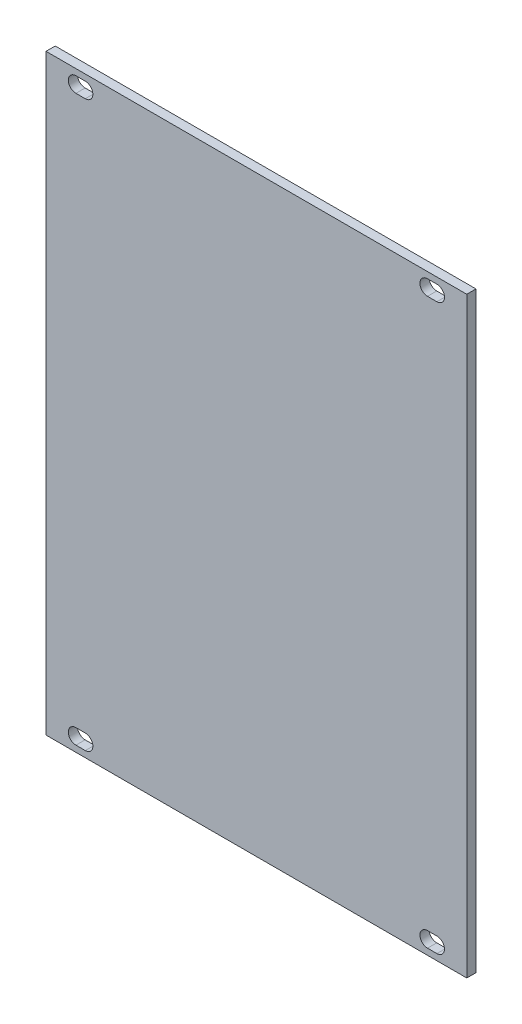
ISO-10303-21;
HEADER;
FILE_DESCRIPTION(('STEP AP214'),'2;1');
FILE_NAME('part.step','',(''),(''),'','','');
FILE_SCHEMA(('AUTOMOTIVE_DESIGN { 1 0 10303 214 1 1 1 1 }'));
ENDSEC;
DATA;
#1=APPLICATION_CONTEXT('core data for automotive mechanical design processes');
#2=APPLICATION_PROTOCOL_DEFINITION('international standard','automotive_design',2000,#1);
#3=PRODUCT_CONTEXT('',#1,'mechanical');
#4=PRODUCT('Part','Part','',(#3));
#5=PRODUCT_RELATED_PRODUCT_CATEGORY('part','',(#4));
#6=PRODUCT_DEFINITION_FORMATION('','',#4);
#7=PRODUCT_DEFINITION_CONTEXT('part definition',#1,'design');
#8=PRODUCT_DEFINITION('design','',#6,#7);
#9=PRODUCT_DEFINITION_SHAPE('','',#8);
#10=(LENGTH_UNIT() NAMED_UNIT(*) SI_UNIT(.MILLI.,.METRE.));
#11=(NAMED_UNIT(*) PLANE_ANGLE_UNIT() SI_UNIT($,.RADIAN.));
#12=(NAMED_UNIT(*) SI_UNIT($,.STERADIAN.) SOLID_ANGLE_UNIT());
#13=UNCERTAINTY_MEASURE_WITH_UNIT(LENGTH_MEASURE(1.E-05),#10,'distance_accuracy_value','');
#14=(GEOMETRIC_REPRESENTATION_CONTEXT(3) GLOBAL_UNCERTAINTY_ASSIGNED_CONTEXT((#13)) GLOBAL_UNIT_ASSIGNED_CONTEXT((#10,
#11,#12)) REPRESENTATION_CONTEXT('',''));
#15=CARTESIAN_POINT('',(0.,0.,0.));
#16=DIRECTION('',(0.,0.,1.));
#17=DIRECTION('',(1.,0.,0.));
#18=AXIS2_PLACEMENT_3D('',#15,#16,#17);
#19=CARTESIAN_POINT('',(0.,0.,2.));
#20=DIRECTION('',(0.,0.,1.));
#21=DIRECTION('',(1.,0.,0.));
#22=AXIS2_PLACEMENT_3D('',#19,#20,#21);
#23=PLANE('',#22);
#24=DIRECTION('',(0.,1.,0.));
#25=VECTOR('',#24,1.);
#26=CARTESIAN_POINT('',(45.65,64.25,2.));
#27=LINE('',#26,#25);
#28=CARTESIAN_POINT('',(45.65,-64.25,2.));
#29=VERTEX_POINT('',#28);
#30=CARTESIAN_POINT('',(45.65,64.25,2.));
#31=VERTEX_POINT('',#30);
#32=EDGE_CURVE('E360',#29,#31,#27,.T.);
#33=ORIENTED_EDGE('',*,*,#32,.T.);
#34=DIRECTION('',(-1.,0.,0.));
#35=VECTOR('',#34,1.);
#36=CARTESIAN_POINT('',(-45.65,64.25,2.));
#37=LINE('',#36,#35);
#38=CARTESIAN_POINT('',(-45.65,64.25,2.));
#39=VERTEX_POINT('',#38);
#40=EDGE_CURVE('E364',#31,#39,#37,.T.);
#41=ORIENTED_EDGE('',*,*,#40,.T.);
#42=DIRECTION('',(0.,-1.,0.));
#43=VECTOR('',#42,1.);
#44=CARTESIAN_POINT('',(-45.65,64.25,2.));
#45=LINE('',#44,#43);
#46=CARTESIAN_POINT('',(-45.65,-64.25,2.));
#47=VERTEX_POINT('',#46);
#48=EDGE_CURVE('E368',#39,#47,#45,.T.);
#49=ORIENTED_EDGE('',*,*,#48,.T.);
#50=DIRECTION('',(1.,0.,0.));
#51=VECTOR('',#50,1.);
#52=CARTESIAN_POINT('',(-45.65,-64.25,2.));
#53=LINE('',#52,#51);
#54=EDGE_CURVE('E371',#47,#29,#53,.T.);
#55=ORIENTED_EDGE('',*,*,#54,.T.);
#56=EDGE_LOOP('',(#33,#41,#49,#55));
#57=FACE_BOUND('',#56,.T.);
#58=DIRECTION('',(1.,0.,0.));
#59=VECTOR('',#58,1.);
#60=CARTESIAN_POINT('',(-39.166,-62.9,2.));
#61=LINE('',#60,#59);
#62=CARTESIAN_POINT('',(-39.166,-62.9,2.));
#63=VERTEX_POINT('',#62);
#64=CARTESIAN_POINT('',(-37.134,-62.9,2.));
#65=VERTEX_POINT('',#64);
#66=EDGE_CURVE('E320',#63,#65,#61,.T.);
#67=ORIENTED_EDGE('',*,*,#66,.F.);
#68=CARTESIAN_POINT('',(-39.166,-61.25,2.));
#69=DIRECTION('',(0.,0.,1.));
#70=DIRECTION('',(1.,0.,0.));
#71=AXIS2_PLACEMENT_3D('',#68,#69,#70);
#72=CIRCLE('',#71,1.65);
#73=CARTESIAN_POINT('',(-39.166,-59.6,2.));
#74=VERTEX_POINT('',#73);
#75=EDGE_CURVE('E317',#74,#63,#72,.T.);
#76=ORIENTED_EDGE('',*,*,#75,.F.);
#77=DIRECTION('',(-1.,0.,0.));
#78=VECTOR('',#77,1.);
#79=CARTESIAN_POINT('',(-39.166,-59.6,2.));
#80=LINE('',#79,#78);
#81=CARTESIAN_POINT('',(-37.134,-59.6,2.));
#82=VERTEX_POINT('',#81);
#83=EDGE_CURVE('E328',#82,#74,#80,.T.);
#84=ORIENTED_EDGE('',*,*,#83,.F.);
#85=CARTESIAN_POINT('',(-37.134,-61.25,2.));
#86=DIRECTION('',(0.,0.,1.));
#87=DIRECTION('',(1.,0.,0.));
#88=AXIS2_PLACEMENT_3D('',#85,#86,#87);
#89=CIRCLE('',#88,1.64999999999999);
#90=EDGE_CURVE('E324',#65,#82,#89,.T.);
#91=ORIENTED_EDGE('',*,*,#90,.F.);
#92=EDGE_LOOP('',(#67,#76,#84,#91));
#93=FACE_BOUND('',#92,.T.);
#94=DIRECTION('',(1.,0.,0.));
#95=VECTOR('',#94,1.);
#96=CARTESIAN_POINT('',(37.134000014,59.6,2.));
#97=LINE('',#96,#95);
#98=CARTESIAN_POINT('',(37.134000014,59.6,2.));
#99=VERTEX_POINT('',#98);
#100=CARTESIAN_POINT('',(39.166000014,59.6,2.));
#101=VERTEX_POINT('',#100);
#102=EDGE_CURVE('E277',#99,#101,#97,.T.);
#103=ORIENTED_EDGE('',*,*,#102,.F.);
#104=CARTESIAN_POINT('',(37.134000014,61.25,2.));
#105=DIRECTION('',(0.,0.,1.));
#106=DIRECTION('',(1.,0.,0.));
#107=AXIS2_PLACEMENT_3D('',#104,#105,#106);
#108=CIRCLE('',#107,1.65);
#109=CARTESIAN_POINT('',(37.134000014,62.9,2.));
#110=VERTEX_POINT('',#109);
#111=EDGE_CURVE('E274',#110,#99,#108,.T.);
#112=ORIENTED_EDGE('',*,*,#111,.F.);
#113=DIRECTION('',(-1.,0.,0.));
#114=VECTOR('',#113,1.);
#115=CARTESIAN_POINT('',(37.134000014,62.9,2.));
#116=LINE('',#115,#114);
#117=CARTESIAN_POINT('',(39.166000014,62.9,2.));
#118=VERTEX_POINT('',#117);
#119=EDGE_CURVE('E285',#118,#110,#116,.T.);
#120=ORIENTED_EDGE('',*,*,#119,.F.);
#121=CARTESIAN_POINT('',(39.166000014,61.25,2.));
#122=DIRECTION('',(0.,0.,1.));
#123=DIRECTION('',(1.,0.,0.));
#124=AXIS2_PLACEMENT_3D('',#121,#122,#123);
#125=CIRCLE('',#124,1.65);
#126=EDGE_CURVE('E281',#101,#118,#125,.T.);
#127=ORIENTED_EDGE('',*,*,#126,.F.);
#128=EDGE_LOOP('',(#103,#112,#120,#127));
#129=FACE_BOUND('',#128,.T.);
#130=DIRECTION('',(1.,0.,0.));
#131=VECTOR('',#130,1.);
#132=CARTESIAN_POINT('',(-39.166,59.6,2.));
#133=LINE('',#132,#131);
#134=CARTESIAN_POINT('',(-39.166,59.6,2.));
#135=VERTEX_POINT('',#134);
#136=CARTESIAN_POINT('',(-37.134,59.6,2.));
#137=VERTEX_POINT('',#136);
#138=EDGE_CURVE('E234',#135,#137,#133,.T.);
#139=ORIENTED_EDGE('',*,*,#138,.F.);
#140=CARTESIAN_POINT('',(-39.166,61.25,2.));
#141=DIRECTION('',(0.,0.,1.));
#142=DIRECTION('',(1.,0.,0.));
#143=AXIS2_PLACEMENT_3D('',#140,#141,#142);
#144=CIRCLE('',#143,1.65);
#145=CARTESIAN_POINT('',(-39.166,62.9,2.));
#146=VERTEX_POINT('',#145);
#147=EDGE_CURVE('E231',#146,#135,#144,.T.);
#148=ORIENTED_EDGE('',*,*,#147,.F.);
#149=DIRECTION('',(-1.,0.,0.));
#150=VECTOR('',#149,1.);
#151=CARTESIAN_POINT('',(-39.166,62.9,2.));
#152=LINE('',#151,#150);
#153=CARTESIAN_POINT('',(-37.134,62.9,2.));
#154=VERTEX_POINT('',#153);
#155=EDGE_CURVE('E242',#154,#146,#152,.T.);
#156=ORIENTED_EDGE('',*,*,#155,.F.);
#157=CARTESIAN_POINT('',(-37.134,61.25,2.));
#158=DIRECTION('',(0.,0.,1.));
#159=DIRECTION('',(1.,0.,0.));
#160=AXIS2_PLACEMENT_3D('',#157,#158,#159);
#161=CIRCLE('',#160,1.65);
#162=EDGE_CURVE('E238',#137,#154,#161,.T.);
#163=ORIENTED_EDGE('',*,*,#162,.F.);
#164=EDGE_LOOP('',(#139,#148,#156,#163));
#165=FACE_BOUND('',#164,.T.);
#166=DIRECTION('',(1.,0.,0.));
#167=VECTOR('',#166,1.);
#168=CARTESIAN_POINT('',(37.134000014,-62.9,2.));
#169=LINE('',#168,#167);
#170=CARTESIAN_POINT('',(37.134000014,-62.9,2.));
#171=VERTEX_POINT('',#170);
#172=CARTESIAN_POINT('',(39.166000014,-62.9,2.));
#173=VERTEX_POINT('',#172);
#174=EDGE_CURVE('E192',#171,#173,#169,.T.);
#175=ORIENTED_EDGE('',*,*,#174,.F.);
#176=CARTESIAN_POINT('',(37.134000014,-61.25,2.));
#177=DIRECTION('',(0.,0.,1.));
#178=DIRECTION('',(1.,0.,0.));
#179=AXIS2_PLACEMENT_3D('',#176,#177,#178);
#180=CIRCLE('',#179,1.65);
#181=CARTESIAN_POINT('',(37.134000014,-59.6,2.));
#182=VERTEX_POINT('',#181);
#183=EDGE_CURVE('E183',#182,#171,#180,.T.);
#184=ORIENTED_EDGE('',*,*,#183,.F.);
#185=DIRECTION('',(-1.,0.,0.));
#186=VECTOR('',#185,1.);
#187=CARTESIAN_POINT('',(37.134000014,-59.6,2.));
#188=LINE('',#187,#186);
#189=CARTESIAN_POINT('',(39.166000014,-59.6,2.));
#190=VERTEX_POINT('',#189);
#191=EDGE_CURVE('E209',#190,#182,#188,.T.);
#192=ORIENTED_EDGE('',*,*,#191,.F.);
#193=CARTESIAN_POINT('',(39.166000014,-61.25,2.));
#194=DIRECTION('',(0.,0.,1.));
#195=DIRECTION('',(1.,0.,0.));
#196=AXIS2_PLACEMENT_3D('',#193,#194,#195);
#197=CIRCLE('',#196,1.65);
#198=EDGE_CURVE('E205',#173,#190,#197,.T.);
#199=ORIENTED_EDGE('',*,*,#198,.F.);
#200=EDGE_LOOP('',(#175,#184,#192,#199));
#201=FACE_BOUND('',#200,.T.);
#202=ADVANCED_FACE('F45',(#57,#93,#129,#165,#201),#23,.T.);
#203=CARTESIAN_POINT('',(0.,0.,0.));
#204=DIRECTION('',(0.,0.,1.));
#205=DIRECTION('',(1.,0.,0.));
#206=AXIS2_PLACEMENT_3D('',#203,#204,#205);
#207=PLANE('',#206);
#208=CARTESIAN_POINT('',(-39.166,61.25,0.));
#209=DIRECTION('',(0.,0.,1.));
#210=DIRECTION('',(1.,0.,0.));
#211=AXIS2_PLACEMENT_3D('',#208,#209,#210);
#212=CIRCLE('',#211,1.65);
#213=CARTESIAN_POINT('',(-39.166,62.9,0.));
#214=VERTEX_POINT('',#213);
#215=CARTESIAN_POINT('',(-39.166,59.6,0.));
#216=VERTEX_POINT('',#215);
#217=EDGE_CURVE('E201',#214,#216,#212,.T.);
#218=ORIENTED_EDGE('',*,*,#217,.T.);
#219=DIRECTION('',(1.,0.,0.));
#220=VECTOR('',#219,1.);
#221=CARTESIAN_POINT('',(-39.166,59.6,0.));
#222=LINE('',#221,#220);
#223=CARTESIAN_POINT('',(-37.134,59.6,0.));
#224=VERTEX_POINT('',#223);
#225=EDGE_CURVE('E249',#216,#224,#222,.T.);
#226=ORIENTED_EDGE('',*,*,#225,.T.);
#227=CARTESIAN_POINT('',(-37.134,61.25,0.));
#228=DIRECTION('',(0.,0.,1.));
#229=DIRECTION('',(1.,0.,0.));
#230=AXIS2_PLACEMENT_3D('',#227,#228,#229);
#231=CIRCLE('',#230,1.65);
#232=CARTESIAN_POINT('',(-37.134,62.9,0.));
#233=VERTEX_POINT('',#232);
#234=EDGE_CURVE('E253',#224,#233,#231,.T.);
#235=ORIENTED_EDGE('',*,*,#234,.T.);
#236=DIRECTION('',(-1.,0.,0.));
#237=VECTOR('',#236,1.);
#238=CARTESIAN_POINT('',(-39.166,62.9,0.));
#239=LINE('',#238,#237);
#240=EDGE_CURVE('E235',#233,#214,#239,.T.);
#241=ORIENTED_EDGE('',*,*,#240,.T.);
#242=EDGE_LOOP('',(#218,#226,#235,#241));
#243=FACE_BOUND('',#242,.T.);
#244=CARTESIAN_POINT('',(-39.166,-61.25,0.));
#245=DIRECTION('',(0.,0.,1.));
#246=DIRECTION('',(1.,0.,0.));
#247=AXIS2_PLACEMENT_3D('',#244,#245,#246);
#248=CIRCLE('',#247,1.65);
#249=CARTESIAN_POINT('',(-39.166,-59.6,0.));
#250=VERTEX_POINT('',#249);
#251=CARTESIAN_POINT('',(-39.166,-62.9,0.));
#252=VERTEX_POINT('',#251);
#253=EDGE_CURVE('E316',#250,#252,#248,.T.);
#254=ORIENTED_EDGE('',*,*,#253,.T.);
#255=DIRECTION('',(1.,0.,0.));
#256=VECTOR('',#255,1.);
#257=CARTESIAN_POINT('',(-39.166,-62.9,0.));
#258=LINE('',#257,#256);
#259=CARTESIAN_POINT('',(-37.134,-62.9,0.));
#260=VERTEX_POINT('',#259);
#261=EDGE_CURVE('E335',#252,#260,#258,.T.);
#262=ORIENTED_EDGE('',*,*,#261,.T.);
#263=CARTESIAN_POINT('',(-37.134,-61.25,0.));
#264=DIRECTION('',(0.,0.,1.));
#265=DIRECTION('',(1.,0.,0.));
#266=AXIS2_PLACEMENT_3D('',#263,#264,#265);
#267=CIRCLE('',#266,1.64999999999999);
#268=CARTESIAN_POINT('',(-37.134,-59.6,0.));
#269=VERTEX_POINT('',#268);
#270=EDGE_CURVE('E339',#260,#269,#267,.T.);
#271=ORIENTED_EDGE('',*,*,#270,.T.);
#272=DIRECTION('',(-1.,0.,0.));
#273=VECTOR('',#272,1.);
#274=CARTESIAN_POINT('',(-39.166,-59.6,0.));
#275=LINE('',#274,#273);
#276=EDGE_CURVE('E321',#269,#250,#275,.T.);
#277=ORIENTED_EDGE('',*,*,#276,.T.);
#278=EDGE_LOOP('',(#254,#262,#271,#277));
#279=FACE_BOUND('',#278,.T.);
#280=DIRECTION('',(0.,1.,0.));
#281=VECTOR('',#280,1.);
#282=CARTESIAN_POINT('',(45.65,64.25,0.));
#283=LINE('',#282,#281);
#284=CARTESIAN_POINT('',(45.65,-64.25,0.));
#285=VERTEX_POINT('',#284);
#286=CARTESIAN_POINT('',(45.65,64.25,0.));
#287=VERTEX_POINT('',#286);
#288=EDGE_CURVE('E359',#285,#287,#283,.T.);
#289=ORIENTED_EDGE('',*,*,#288,.F.);
#290=DIRECTION('',(1.,0.,0.));
#291=VECTOR('',#290,1.);
#292=CARTESIAN_POINT('',(-45.65,-64.25,0.));
#293=LINE('',#292,#291);
#294=CARTESIAN_POINT('',(-45.65,-64.25,0.));
#295=VERTEX_POINT('',#294);
#296=EDGE_CURVE('E365',#295,#285,#293,.T.);
#297=ORIENTED_EDGE('',*,*,#296,.F.);
#298=DIRECTION('',(0.,-1.,0.));
#299=VECTOR('',#298,1.);
#300=CARTESIAN_POINT('',(-45.65,64.25,0.));
#301=LINE('',#300,#299);
#302=CARTESIAN_POINT('',(-45.65,64.25,0.));
#303=VERTEX_POINT('',#302);
#304=EDGE_CURVE('E381',#303,#295,#301,.T.);
#305=ORIENTED_EDGE('',*,*,#304,.F.);
#306=DIRECTION('',(-1.,0.,0.));
#307=VECTOR('',#306,1.);
#308=CARTESIAN_POINT('',(-45.65,64.25,0.));
#309=LINE('',#308,#307);
#310=EDGE_CURVE('E378',#287,#303,#309,.T.);
#311=ORIENTED_EDGE('',*,*,#310,.F.);
#312=EDGE_LOOP('',(#289,#297,#305,#311));
#313=FACE_BOUND('',#312,.T.);
#314=CARTESIAN_POINT('',(37.134000014,61.25,0.));
#315=DIRECTION('',(0.,0.,1.));
#316=DIRECTION('',(1.,0.,0.));
#317=AXIS2_PLACEMENT_3D('',#314,#315,#316);
#318=CIRCLE('',#317,1.65);
#319=CARTESIAN_POINT('',(37.134000014,62.9,0.));
#320=VERTEX_POINT('',#319);
#321=CARTESIAN_POINT('',(37.134000014,59.6,0.));
#322=VERTEX_POINT('',#321);
#323=EDGE_CURVE('E273',#320,#322,#318,.T.);
#324=ORIENTED_EDGE('',*,*,#323,.T.);
#325=DIRECTION('',(1.,0.,0.));
#326=VECTOR('',#325,1.);
#327=CARTESIAN_POINT('',(37.134000014,59.6,0.));
#328=LINE('',#327,#326);
#329=CARTESIAN_POINT('',(39.166000014,59.6,0.));
#330=VERTEX_POINT('',#329);
#331=EDGE_CURVE('E292',#322,#330,#328,.T.);
#332=ORIENTED_EDGE('',*,*,#331,.T.);
#333=CARTESIAN_POINT('',(39.166000014,61.25,0.));
#334=DIRECTION('',(0.,0.,1.));
#335=DIRECTION('',(1.,0.,0.));
#336=AXIS2_PLACEMENT_3D('',#333,#334,#335);
#337=CIRCLE('',#336,1.65);
#338=CARTESIAN_POINT('',(39.166000014,62.9,0.));
#339=VERTEX_POINT('',#338);
#340=EDGE_CURVE('E296',#330,#339,#337,.T.);
#341=ORIENTED_EDGE('',*,*,#340,.T.);
#342=DIRECTION('',(-1.,0.,0.));
#343=VECTOR('',#342,1.);
#344=CARTESIAN_POINT('',(37.134000014,62.9,0.));
#345=LINE('',#344,#343);
#346=EDGE_CURVE('E278',#339,#320,#345,.T.);
#347=ORIENTED_EDGE('',*,*,#346,.T.);
#348=EDGE_LOOP('',(#324,#332,#341,#347));
#349=FACE_BOUND('',#348,.T.);
#350=CARTESIAN_POINT('',(37.134000014,-61.25,0.));
#351=DIRECTION('',(0.,0.,1.));
#352=DIRECTION('',(1.,0.,0.));
#353=AXIS2_PLACEMENT_3D('',#350,#351,#352);
#354=CIRCLE('',#353,1.65);
#355=CARTESIAN_POINT('',(37.134000014,-59.6,0.));
#356=VERTEX_POINT('',#355);
#357=CARTESIAN_POINT('',(37.134000014,-62.9,0.));
#358=VERTEX_POINT('',#357);
#359=EDGE_CURVE('E69',#356,#358,#354,.T.);
#360=ORIENTED_EDGE('',*,*,#359,.T.);
#361=DIRECTION('',(1.,0.,0.));
#362=VECTOR('',#361,1.);
#363=CARTESIAN_POINT('',(37.134000014,-62.9,0.));
#364=LINE('',#363,#362);
#365=CARTESIAN_POINT('',(39.166000014,-62.9,0.));
#366=VERTEX_POINT('',#365);
#367=EDGE_CURVE('E199',#358,#366,#364,.T.);
#368=ORIENTED_EDGE('',*,*,#367,.T.);
#369=CARTESIAN_POINT('',(39.166000014,-61.25,0.));
#370=DIRECTION('',(0.,0.,1.));
#371=DIRECTION('',(1.,0.,0.));
#372=AXIS2_PLACEMENT_3D('',#369,#370,#371);
#373=CIRCLE('',#372,1.65);
#374=CARTESIAN_POINT('',(39.166000014,-59.6,0.));
#375=VERTEX_POINT('',#374);
#376=EDGE_CURVE('E218',#366,#375,#373,.T.);
#377=ORIENTED_EDGE('',*,*,#376,.T.);
#378=DIRECTION('',(-1.,0.,0.));
#379=VECTOR('',#378,1.);
#380=CARTESIAN_POINT('',(37.134000014,-59.6,0.));
#381=LINE('',#380,#379);
#382=EDGE_CURVE('E193',#375,#356,#381,.T.);
#383=ORIENTED_EDGE('',*,*,#382,.T.);
#384=EDGE_LOOP('',(#360,#368,#377,#383));
#385=FACE_BOUND('',#384,.T.);
#386=ADVANCED_FACE('F404',(#243,#279,#313,#349,#385),#207,.F.);
#387=CARTESIAN_POINT('',(45.65,64.25,2.));
#388=DIRECTION('',(-1.,0.,0.));
#389=DIRECTION('',(0.,-1.,0.));
#390=AXIS2_PLACEMENT_3D('',#387,#388,#389);
#391=PLANE('',#390);
#392=ORIENTED_EDGE('',*,*,#288,.T.);
#393=DIRECTION('',(0.,0.,-1.));
#394=VECTOR('',#393,1.);
#395=CARTESIAN_POINT('',(45.65,64.25,2.));
#396=LINE('',#395,#394);
#397=EDGE_CURVE('E11',#31,#287,#396,.T.);
#398=ORIENTED_EDGE('',*,*,#397,.F.);
#399=ORIENTED_EDGE('',*,*,#32,.F.);
#400=DIRECTION('',(0.,0.,-1.));
#401=VECTOR('',#400,1.);
#402=CARTESIAN_POINT('',(45.65,-64.25,2.));
#403=LINE('',#402,#401);
#404=EDGE_CURVE('E374',#29,#285,#403,.T.);
#405=ORIENTED_EDGE('',*,*,#404,.T.);
#406=EDGE_LOOP('',(#392,#398,#399,#405));
#407=FACE_BOUND('',#406,.T.);
#408=ADVANCED_FACE('F47',(#407),#391,.F.);
#409=CARTESIAN_POINT('',(-45.65,64.25,2.));
#410=DIRECTION('',(0.,-1.,0.));
#411=DIRECTION('',(0.,0.,-1.));
#412=AXIS2_PLACEMENT_3D('',#409,#410,#411);
#413=PLANE('',#412);
#414=ORIENTED_EDGE('',*,*,#310,.T.);
#415=DIRECTION('',(0.,0.,-1.));
#416=VECTOR('',#415,1.);
#417=CARTESIAN_POINT('',(-45.65,64.25,2.));
#418=LINE('',#417,#416);
#419=EDGE_CURVE('E54',#39,#303,#418,.T.);
#420=ORIENTED_EDGE('',*,*,#419,.F.);
#421=ORIENTED_EDGE('',*,*,#40,.F.);
#422=ORIENTED_EDGE('',*,*,#397,.T.);
#423=EDGE_LOOP('',(#414,#420,#421,#422));
#424=FACE_BOUND('',#423,.T.);
#425=ADVANCED_FACE('F415',(#424),#413,.F.);
#426=CARTESIAN_POINT('',(-45.65,64.25,2.));
#427=DIRECTION('',(1.,0.,0.));
#428=DIRECTION('',(0.,1.,0.));
#429=AXIS2_PLACEMENT_3D('',#426,#427,#428);
#430=PLANE('',#429);
#431=ORIENTED_EDGE('',*,*,#304,.T.);
#432=DIRECTION('',(0.,0.,-1.));
#433=VECTOR('',#432,1.);
#434=CARTESIAN_POINT('',(-45.65,-64.25,2.));
#435=LINE('',#434,#433);
#436=EDGE_CURVE('E389',#47,#295,#435,.T.);
#437=ORIENTED_EDGE('',*,*,#436,.F.);
#438=ORIENTED_EDGE('',*,*,#48,.F.);
#439=ORIENTED_EDGE('',*,*,#419,.T.);
#440=EDGE_LOOP('',(#431,#437,#438,#439));
#441=FACE_BOUND('',#440,.T.);
#442=ADVANCED_FACE('F398',(#441),#430,.F.);
#443=CARTESIAN_POINT('',(-45.65,-64.25,2.));
#444=DIRECTION('',(0.,1.,0.));
#445=DIRECTION('',(0.,0.,1.));
#446=AXIS2_PLACEMENT_3D('',#443,#444,#445);
#447=PLANE('',#446);
#448=ORIENTED_EDGE('',*,*,#296,.T.);
#449=ORIENTED_EDGE('',*,*,#404,.F.);
#450=ORIENTED_EDGE('',*,*,#54,.F.);
#451=ORIENTED_EDGE('',*,*,#436,.T.);
#452=EDGE_LOOP('',(#448,#449,#450,#451));
#453=FACE_BOUND('',#452,.T.);
#454=ADVANCED_FACE('F408',(#453),#447,.F.);
#455=CARTESIAN_POINT('',(-39.166,-61.25,2.));
#456=DIRECTION('',(0.,0.,-1.));
#457=DIRECTION('',(-1.,0.,0.));
#458=AXIS2_PLACEMENT_3D('',#455,#456,#457);
#459=CYLINDRICAL_SURFACE('',#458,1.65);
#460=ORIENTED_EDGE('',*,*,#253,.F.);
#461=DIRECTION('',(0.,0.,-1.));
#462=VECTOR('',#461,1.);
#463=CARTESIAN_POINT('',(-39.166,-59.6,2.));
#464=LINE('',#463,#462);
#465=EDGE_CURVE('E331',#74,#250,#464,.T.);
#466=ORIENTED_EDGE('',*,*,#465,.F.);
#467=ORIENTED_EDGE('',*,*,#75,.T.);
#468=DIRECTION('',(0.,0.,-1.));
#469=VECTOR('',#468,1.);
#470=CARTESIAN_POINT('',(-39.166,-62.9,2.));
#471=LINE('',#470,#469);
#472=EDGE_CURVE('E355',#63,#252,#471,.T.);
#473=ORIENTED_EDGE('',*,*,#472,.T.);
#474=EDGE_LOOP('',(#460,#466,#467,#473));
#475=FACE_BOUND('',#474,.T.);
#476=ADVANCED_FACE('F430',(#475),#459,.F.);
#477=CARTESIAN_POINT('',(-39.166,-62.9,2.));
#478=DIRECTION('',(0.,1.,0.));
#479=DIRECTION('',(-1.,0.,0.));
#480=AXIS2_PLACEMENT_3D('',#477,#478,#479);
#481=PLANE('',#480);
#482=ORIENTED_EDGE('',*,*,#261,.F.);
#483=ORIENTED_EDGE('',*,*,#472,.F.);
#484=ORIENTED_EDGE('',*,*,#66,.T.);
#485=DIRECTION('',(0.,0.,-1.));
#486=VECTOR('',#485,1.);
#487=CARTESIAN_POINT('',(-37.134,-62.9,2.));
#488=LINE('',#487,#486);
#489=EDGE_CURVE('E352',#65,#260,#488,.T.);
#490=ORIENTED_EDGE('',*,*,#489,.T.);
#491=EDGE_LOOP('',(#482,#483,#484,#490));
#492=FACE_BOUND('',#491,.T.);
#493=ADVANCED_FACE('F437',(#492),#481,.T.);
#494=CARTESIAN_POINT('',(-37.134,-61.25,2.));
#495=DIRECTION('',(0.,0.,-1.));
#496=DIRECTION('',(-1.,0.,0.));
#497=AXIS2_PLACEMENT_3D('',#494,#495,#496);
#498=CYLINDRICAL_SURFACE('',#497,1.64999999999999);
#499=ORIENTED_EDGE('',*,*,#270,.F.);
#500=ORIENTED_EDGE('',*,*,#489,.F.);
#501=ORIENTED_EDGE('',*,*,#90,.T.);
#502=DIRECTION('',(0.,0.,-1.));
#503=VECTOR('',#502,1.);
#504=CARTESIAN_POINT('',(-37.134,-59.6,2.));
#505=LINE('',#504,#503);
#506=EDGE_CURVE('E349',#82,#269,#505,.T.);
#507=ORIENTED_EDGE('',*,*,#506,.T.);
#508=EDGE_LOOP('',(#499,#500,#501,#507));
#509=FACE_BOUND('',#508,.T.);
#510=ADVANCED_FACE('F442',(#509),#498,.F.);
#511=CARTESIAN_POINT('',(-39.166,-59.6,2.));
#512=DIRECTION('',(0.,-1.,0.));
#513=DIRECTION('',(0.,0.,-1.));
#514=AXIS2_PLACEMENT_3D('',#511,#512,#513);
#515=PLANE('',#514);
#516=ORIENTED_EDGE('',*,*,#276,.F.);
#517=ORIENTED_EDGE('',*,*,#506,.F.);
#518=ORIENTED_EDGE('',*,*,#83,.T.);
#519=ORIENTED_EDGE('',*,*,#465,.T.);
#520=EDGE_LOOP('',(#516,#517,#518,#519));
#521=FACE_BOUND('',#520,.T.);
#522=ADVANCED_FACE('F450',(#521),#515,.T.);
#523=CARTESIAN_POINT('',(37.134000014,61.25,2.));
#524=DIRECTION('',(0.,0.,-1.));
#525=DIRECTION('',(-1.,0.,0.));
#526=AXIS2_PLACEMENT_3D('',#523,#524,#525);
#527=CYLINDRICAL_SURFACE('',#526,1.65);
#528=ORIENTED_EDGE('',*,*,#323,.F.);
#529=DIRECTION('',(0.,0.,-1.));
#530=VECTOR('',#529,1.);
#531=CARTESIAN_POINT('',(37.134000014,62.9,2.));
#532=LINE('',#531,#530);
#533=EDGE_CURVE('E288',#110,#320,#532,.T.);
#534=ORIENTED_EDGE('',*,*,#533,.F.);
#535=ORIENTED_EDGE('',*,*,#111,.T.);
#536=DIRECTION('',(0.,0.,-1.));
#537=VECTOR('',#536,1.);
#538=CARTESIAN_POINT('',(37.134000014,59.6,2.));
#539=LINE('',#538,#537);
#540=EDGE_CURVE('E312',#99,#322,#539,.T.);
#541=ORIENTED_EDGE('',*,*,#540,.T.);
#542=EDGE_LOOP('',(#528,#534,#535,#541));
#543=FACE_BOUND('',#542,.T.);
#544=ADVANCED_FACE('F504',(#543),#527,.F.);
#545=CARTESIAN_POINT('',(37.134000014,59.6,2.));
#546=DIRECTION('',(0.,1.,0.));
#547=DIRECTION('',(0.,0.,1.));
#548=AXIS2_PLACEMENT_3D('',#545,#546,#547);
#549=PLANE('',#548);
#550=ORIENTED_EDGE('',*,*,#331,.F.);
#551=ORIENTED_EDGE('',*,*,#540,.F.);
#552=ORIENTED_EDGE('',*,*,#102,.T.);
#553=DIRECTION('',(0.,0.,-1.));
#554=VECTOR('',#553,1.);
#555=CARTESIAN_POINT('',(39.166000014,59.6,2.));
#556=LINE('',#555,#554);
#557=EDGE_CURVE('E309',#101,#330,#556,.T.);
#558=ORIENTED_EDGE('',*,*,#557,.T.);
#559=EDGE_LOOP('',(#550,#551,#552,#558));
#560=FACE_BOUND('',#559,.T.);
#561=ADVANCED_FACE('F500',(#560),#549,.T.);
#562=CARTESIAN_POINT('',(39.166000014,61.25,2.));
#563=DIRECTION('',(0.,0.,-1.));
#564=DIRECTION('',(-1.,0.,0.));
#565=AXIS2_PLACEMENT_3D('',#562,#563,#564);
#566=CYLINDRICAL_SURFACE('',#565,1.65);
#567=ORIENTED_EDGE('',*,*,#340,.F.);
#568=ORIENTED_EDGE('',*,*,#557,.F.);
#569=ORIENTED_EDGE('',*,*,#126,.T.);
#570=DIRECTION('',(0.,0.,-1.));
#571=VECTOR('',#570,1.);
#572=CARTESIAN_POINT('',(39.166000014,62.9,2.));
#573=LINE('',#572,#571);
#574=EDGE_CURVE('E306',#118,#339,#573,.T.);
#575=ORIENTED_EDGE('',*,*,#574,.T.);
#576=EDGE_LOOP('',(#567,#568,#569,#575));
#577=FACE_BOUND('',#576,.T.);
#578=ADVANCED_FACE('F496',(#577),#566,.F.);
#579=CARTESIAN_POINT('',(37.134000014,62.9,2.));
#580=DIRECTION('',(0.,-1.,0.));
#581=DIRECTION('',(0.,0.,-1.));
#582=AXIS2_PLACEMENT_3D('',#579,#580,#581);
#583=PLANE('',#582);
#584=ORIENTED_EDGE('',*,*,#346,.F.);
#585=ORIENTED_EDGE('',*,*,#574,.F.);
#586=ORIENTED_EDGE('',*,*,#119,.T.);
#587=ORIENTED_EDGE('',*,*,#533,.T.);
#588=EDGE_LOOP('',(#584,#585,#586,#587));
#589=FACE_BOUND('',#588,.T.);
#590=ADVANCED_FACE('F493',(#589),#583,.T.);
#591=CARTESIAN_POINT('',(-39.166,61.25,2.));
#592=DIRECTION('',(0.,0.,-1.));
#593=DIRECTION('',(-1.,0.,0.));
#594=AXIS2_PLACEMENT_3D('',#591,#592,#593);
#595=CYLINDRICAL_SURFACE('',#594,1.65);
#596=ORIENTED_EDGE('',*,*,#217,.F.);
#597=DIRECTION('',(0.,0.,-1.));
#598=VECTOR('',#597,1.);
#599=CARTESIAN_POINT('',(-39.166,62.9,2.));
#600=LINE('',#599,#598);
#601=EDGE_CURVE('E245',#146,#214,#600,.T.);
#602=ORIENTED_EDGE('',*,*,#601,.F.);
#603=ORIENTED_EDGE('',*,*,#147,.T.);
#604=DIRECTION('',(0.,0.,-1.));
#605=VECTOR('',#604,1.);
#606=CARTESIAN_POINT('',(-39.166,59.6,2.));
#607=LINE('',#606,#605);
#608=EDGE_CURVE('E269',#135,#216,#607,.T.);
#609=ORIENTED_EDGE('',*,*,#608,.T.);
#610=EDGE_LOOP('',(#596,#602,#603,#609));
#611=FACE_BOUND('',#610,.T.);
#612=ADVANCED_FACE('F475',(#611),#595,.F.);
#613=CARTESIAN_POINT('',(-39.166,59.6,2.));
#614=DIRECTION('',(0.,1.,0.));
#615=DIRECTION('',(0.,0.,1.));
#616=AXIS2_PLACEMENT_3D('',#613,#614,#615);
#617=PLANE('',#616);
#618=ORIENTED_EDGE('',*,*,#225,.F.);
#619=ORIENTED_EDGE('',*,*,#608,.F.);
#620=ORIENTED_EDGE('',*,*,#138,.T.);
#621=DIRECTION('',(0.,0.,-1.));
#622=VECTOR('',#621,1.);
#623=CARTESIAN_POINT('',(-37.134,59.6,2.));
#624=LINE('',#623,#622);
#625=EDGE_CURVE('E266',#137,#224,#624,.T.);
#626=ORIENTED_EDGE('',*,*,#625,.T.);
#627=EDGE_LOOP('',(#618,#619,#620,#626));
#628=FACE_BOUND('',#627,.T.);
#629=ADVANCED_FACE('F469',(#628),#617,.T.);
#630=CARTESIAN_POINT('',(-37.134,61.25,2.));
#631=DIRECTION('',(0.,0.,-1.));
#632=DIRECTION('',(-1.,0.,0.));
#633=AXIS2_PLACEMENT_3D('',#630,#631,#632);
#634=CYLINDRICAL_SURFACE('',#633,1.65);
#635=ORIENTED_EDGE('',*,*,#234,.F.);
#636=ORIENTED_EDGE('',*,*,#625,.F.);
#637=ORIENTED_EDGE('',*,*,#162,.T.);
#638=DIRECTION('',(0.,0.,-1.));
#639=VECTOR('',#638,1.);
#640=CARTESIAN_POINT('',(-37.134,62.9,2.));
#641=LINE('',#640,#639);
#642=EDGE_CURVE('E263',#154,#233,#641,.T.);
#643=ORIENTED_EDGE('',*,*,#642,.T.);
#644=EDGE_LOOP('',(#635,#636,#637,#643));
#645=FACE_BOUND('',#644,.T.);
#646=ADVANCED_FACE('F472',(#645),#634,.F.);
#647=CARTESIAN_POINT('',(-39.166,62.9,2.));
#648=DIRECTION('',(0.,-1.,0.));
#649=DIRECTION('',(0.,0.,-1.));
#650=AXIS2_PLACEMENT_3D('',#647,#648,#649);
#651=PLANE('',#650);
#652=ORIENTED_EDGE('',*,*,#240,.F.);
#653=ORIENTED_EDGE('',*,*,#642,.F.);
#654=ORIENTED_EDGE('',*,*,#155,.T.);
#655=ORIENTED_EDGE('',*,*,#601,.T.);
#656=EDGE_LOOP('',(#652,#653,#654,#655));
#657=FACE_BOUND('',#656,.T.);
#658=ADVANCED_FACE('F478',(#657),#651,.T.);
#659=CARTESIAN_POINT('',(37.134000014,-61.25,2.));
#660=DIRECTION('',(0.,0.,-1.));
#661=DIRECTION('',(-1.,0.,0.));
#662=AXIS2_PLACEMENT_3D('',#659,#660,#661);
#663=CYLINDRICAL_SURFACE('',#662,1.65);
#664=ORIENTED_EDGE('',*,*,#359,.F.);
#665=DIRECTION('',(0.,0.,-1.));
#666=VECTOR('',#665,1.);
#667=CARTESIAN_POINT('',(37.134000014,-59.6,2.));
#668=LINE('',#667,#666);
#669=EDGE_CURVE('E187',#182,#356,#668,.T.);
#670=ORIENTED_EDGE('',*,*,#669,.F.);
#671=ORIENTED_EDGE('',*,*,#183,.T.);
#672=DIRECTION('',(0.,0.,-1.));
#673=VECTOR('',#672,1.);
#674=CARTESIAN_POINT('',(37.134000014,-62.9,2.));
#675=LINE('',#674,#673);
#676=EDGE_CURVE('E186',#171,#358,#675,.T.);
#677=ORIENTED_EDGE('',*,*,#676,.T.);
#678=EDGE_LOOP('',(#664,#670,#671,#677));
#679=FACE_BOUND('',#678,.T.);
#680=ADVANCED_FACE('F185',(#679),#663,.F.);
#681=CARTESIAN_POINT('',(37.134000014,-62.9,2.));
#682=DIRECTION('',(0.,1.,0.));
#683=DIRECTION('',(0.,0.,1.));
#684=AXIS2_PLACEMENT_3D('',#681,#682,#683);
#685=PLANE('',#684);
#686=ORIENTED_EDGE('',*,*,#367,.F.);
#687=ORIENTED_EDGE('',*,*,#676,.F.);
#688=ORIENTED_EDGE('',*,*,#174,.T.);
#689=DIRECTION('',(0.,0.,-1.));
#690=VECTOR('',#689,1.);
#691=CARTESIAN_POINT('',(39.166000014,-62.9,2.));
#692=LINE('',#691,#690);
#693=EDGE_CURVE('E202',#173,#366,#692,.T.);
#694=ORIENTED_EDGE('',*,*,#693,.T.);
#695=EDGE_LOOP('',(#686,#687,#688,#694));
#696=FACE_BOUND('',#695,.T.);
#697=ADVANCED_FACE('F196',(#696),#685,.T.);
#698=CARTESIAN_POINT('',(39.166000014,-61.25,2.));
#699=DIRECTION('',(0.,0.,-1.));
#700=DIRECTION('',(-1.,0.,0.));
#701=AXIS2_PLACEMENT_3D('',#698,#699,#700);
#702=CYLINDRICAL_SURFACE('',#701,1.65);
#703=ORIENTED_EDGE('',*,*,#376,.F.);
#704=ORIENTED_EDGE('',*,*,#693,.F.);
#705=ORIENTED_EDGE('',*,*,#198,.T.);
#706=DIRECTION('',(0.,0.,-1.));
#707=VECTOR('',#706,1.);
#708=CARTESIAN_POINT('',(39.166000014,-59.6,2.));
#709=LINE('',#708,#707);
#710=EDGE_CURVE('E61',#190,#375,#709,.T.);
#711=ORIENTED_EDGE('',*,*,#710,.T.);
#712=EDGE_LOOP('',(#703,#704,#705,#711));
#713=FACE_BOUND('',#712,.T.);
#714=ADVANCED_FACE('F576',(#713),#702,.F.);
#715=CARTESIAN_POINT('',(37.134000014,-59.6,2.));
#716=DIRECTION('',(0.,-1.,0.));
#717=DIRECTION('',(0.,0.,-1.));
#718=AXIS2_PLACEMENT_3D('',#715,#716,#717);
#719=PLANE('',#718);
#720=ORIENTED_EDGE('',*,*,#382,.F.);
#721=ORIENTED_EDGE('',*,*,#710,.F.);
#722=ORIENTED_EDGE('',*,*,#191,.T.);
#723=ORIENTED_EDGE('',*,*,#669,.T.);
#724=EDGE_LOOP('',(#720,#721,#722,#723));
#725=FACE_BOUND('',#724,.T.);
#726=ADVANCED_FACE('F584',(#725),#719,.T.);
#727=CLOSED_SHELL('',(#202,#386,#408,#425,#442,#454,#476,#493,#510,#522,#544,#561,#578,#590,
#612,#629,#646,#658,#680,#697,#714,#726));
#728=MANIFOLD_SOLID_BREP('B2',#727);
#729=ADVANCED_BREP_SHAPE_REPRESENTATION('',(#18,#728),#14);
#730=SHAPE_DEFINITION_REPRESENTATION(#9,#729);
ENDSEC;
END-ISO-10303-21;
